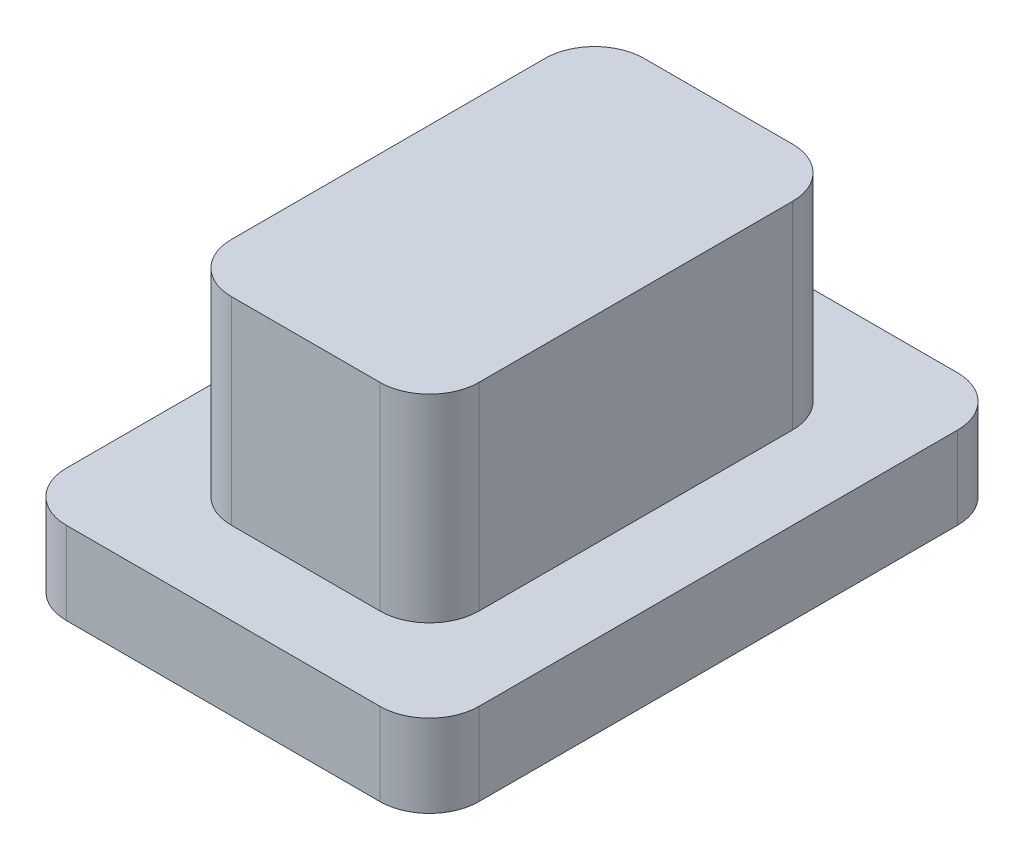
ISO-10303-21;
HEADER;
FILE_DESCRIPTION(('STEP AP214'),'2;1');
FILE_NAME('part.step','',(''),(''),'','','');
FILE_SCHEMA(('AUTOMOTIVE_DESIGN { 1 0 10303 214 1 1 1 1 }'));
ENDSEC;
DATA;
#1=APPLICATION_CONTEXT('core data for automotive mechanical design processes');
#2=APPLICATION_PROTOCOL_DEFINITION('international standard','automotive_design',2000,#1);
#3=PRODUCT_CONTEXT('',#1,'mechanical');
#4=PRODUCT('Part','Part','',(#3));
#5=PRODUCT_RELATED_PRODUCT_CATEGORY('part','',(#4));
#6=PRODUCT_DEFINITION_FORMATION('','',#4);
#7=PRODUCT_DEFINITION_CONTEXT('part definition',#1,'design');
#8=PRODUCT_DEFINITION('design','',#6,#7);
#9=PRODUCT_DEFINITION_SHAPE('','',#8);
#10=(LENGTH_UNIT() NAMED_UNIT(*) SI_UNIT(.MILLI.,.METRE.));
#11=(NAMED_UNIT(*) PLANE_ANGLE_UNIT() SI_UNIT($,.RADIAN.));
#12=(NAMED_UNIT(*) SI_UNIT($,.STERADIAN.) SOLID_ANGLE_UNIT());
#13=UNCERTAINTY_MEASURE_WITH_UNIT(LENGTH_MEASURE(1.E-05),#10,'distance_accuracy_value','');
#14=(GEOMETRIC_REPRESENTATION_CONTEXT(3) GLOBAL_UNCERTAINTY_ASSIGNED_CONTEXT((#13)) GLOBAL_UNIT_ASSIGNED_CONTEXT((#10,
#11,#12)) REPRESENTATION_CONTEXT('',''));
#15=CARTESIAN_POINT('',(0.,0.,0.));
#16=DIRECTION('',(0.,0.,1.));
#17=DIRECTION('',(1.,0.,0.));
#18=AXIS2_PLACEMENT_3D('',#15,#16,#17);
#19=CARTESIAN_POINT('',(2.5,1.,-3.5));
#20=DIRECTION('',(-1.,0.,0.));
#21=DIRECTION('',(0.,0.,1.));
#22=AXIS2_PLACEMENT_3D('',#19,#20,#21);
#23=PLANE('',#22);
#24=DIRECTION('',(0.,0.,-1.));
#25=VECTOR('',#24,1.);
#26=CARTESIAN_POINT('',(2.5,0.,-3.5));
#27=LINE('',#26,#25);
#28=CARTESIAN_POINT('',(2.5,0.,2.9));
#29=VERTEX_POINT('',#28);
#30=CARTESIAN_POINT('',(2.5,0.,-2.9));
#31=VERTEX_POINT('',#30);
#32=EDGE_CURVE('E176',#29,#31,#27,.T.);
#33=ORIENTED_EDGE('',*,*,#32,.T.);
#34=DIRECTION('',(0.,-1.,0.));
#35=VECTOR('',#34,1.);
#36=CARTESIAN_POINT('',(2.5,1.,-2.9));
#37=LINE('',#36,#35);
#38=CARTESIAN_POINT('',(2.5,1.,-2.9));
#39=VERTEX_POINT('',#38);
#40=EDGE_CURVE('E154',#31,#39,#37,.F.);
#41=ORIENTED_EDGE('',*,*,#40,.T.);
#42=DIRECTION('',(0.,0.,-1.));
#43=VECTOR('',#42,1.);
#44=CARTESIAN_POINT('',(2.5,1.,-3.5));
#45=LINE('',#44,#43);
#46=CARTESIAN_POINT('',(2.5,1.,2.9));
#47=VERTEX_POINT('',#46);
#48=EDGE_CURVE('E187',#47,#39,#45,.T.);
#49=ORIENTED_EDGE('',*,*,#48,.F.);
#50=DIRECTION('',(0.,-1.,0.));
#51=VECTOR('',#50,1.);
#52=CARTESIAN_POINT('',(2.5,1.,2.9));
#53=LINE('',#52,#51);
#54=EDGE_CURVE('E159',#47,#29,#53,.T.);
#55=ORIENTED_EDGE('',*,*,#54,.T.);
#56=EDGE_LOOP('',(#33,#41,#49,#55));
#57=FACE_BOUND('',#56,.T.);
#58=ADVANCED_FACE('F35',(#57),#23,.F.);
#59=CARTESIAN_POINT('',(-2.5,1.,-3.5));
#60=DIRECTION('',(0.,0.,1.));
#61=DIRECTION('',(1.,0.,0.));
#62=AXIS2_PLACEMENT_3D('',#59,#60,#61);
#63=PLANE('',#62);
#64=DIRECTION('',(-1.,0.,0.));
#65=VECTOR('',#64,1.);
#66=CARTESIAN_POINT('',(-2.5,1.,-3.5));
#67=LINE('',#66,#65);
#68=CARTESIAN_POINT('',(1.9,1.,-3.5));
#69=VERTEX_POINT('',#68);
#70=CARTESIAN_POINT('',(-1.9,1.,-3.5));
#71=VERTEX_POINT('',#70);
#72=EDGE_CURVE('E169',#69,#71,#67,.T.);
#73=ORIENTED_EDGE('',*,*,#72,.F.);
#74=DIRECTION('',(0.,-1.,0.));
#75=VECTOR('',#74,1.);
#76=CARTESIAN_POINT('',(1.9,1.,-3.5));
#77=LINE('',#76,#75);
#78=CARTESIAN_POINT('',(1.9,0.,-3.5));
#79=VERTEX_POINT('',#78);
#80=EDGE_CURVE('E153',#69,#79,#77,.T.);
#81=ORIENTED_EDGE('',*,*,#80,.T.);
#82=DIRECTION('',(-1.,0.,0.));
#83=VECTOR('',#82,1.);
#84=CARTESIAN_POINT('',(-2.5,0.,-3.5));
#85=LINE('',#84,#83);
#86=CARTESIAN_POINT('',(-1.9,0.,-3.5));
#87=VERTEX_POINT('',#86);
#88=EDGE_CURVE('E166',#79,#87,#85,.T.);
#89=ORIENTED_EDGE('',*,*,#88,.T.);
#90=DIRECTION('',(0.,-1.,0.));
#91=VECTOR('',#90,1.);
#92=CARTESIAN_POINT('',(-1.9,1.,-3.5));
#93=LINE('',#92,#91);
#94=EDGE_CURVE('E171',#87,#71,#93,.F.);
#95=ORIENTED_EDGE('',*,*,#94,.T.);
#96=EDGE_LOOP('',(#73,#81,#89,#95));
#97=FACE_BOUND('',#96,.T.);
#98=ADVANCED_FACE('F165',(#97),#63,.F.);
#99=CARTESIAN_POINT('',(-2.5,1.,-3.5));
#100=DIRECTION('',(1.,0.,0.));
#101=DIRECTION('',(0.,0.,-1.));
#102=AXIS2_PLACEMENT_3D('',#99,#100,#101);
#103=PLANE('',#102);
#104=DIRECTION('',(0.,0.,1.));
#105=VECTOR('',#104,1.);
#106=CARTESIAN_POINT('',(-2.5,1.,-3.5));
#107=LINE('',#106,#105);
#108=CARTESIAN_POINT('',(-2.5,1.,-2.9));
#109=VERTEX_POINT('',#108);
#110=CARTESIAN_POINT('',(-2.5,1.,2.9));
#111=VERTEX_POINT('',#110);
#112=EDGE_CURVE('E285',#109,#111,#107,.T.);
#113=ORIENTED_EDGE('',*,*,#112,.F.);
#114=DIRECTION('',(0.,-1.,0.));
#115=VECTOR('',#114,1.);
#116=CARTESIAN_POINT('',(-2.5,1.,-2.9));
#117=LINE('',#116,#115);
#118=CARTESIAN_POINT('',(-2.5,0.,-2.9));
#119=VERTEX_POINT('',#118);
#120=EDGE_CURVE('E207',#109,#119,#117,.T.);
#121=ORIENTED_EDGE('',*,*,#120,.T.);
#122=DIRECTION('',(0.,0.,1.));
#123=VECTOR('',#122,1.);
#124=CARTESIAN_POINT('',(-2.5,0.,-3.5));
#125=LINE('',#124,#123);
#126=CARTESIAN_POINT('',(-2.5,0.,2.9));
#127=VERTEX_POINT('',#126);
#128=EDGE_CURVE('E175',#119,#127,#125,.T.);
#129=ORIENTED_EDGE('',*,*,#128,.T.);
#130=DIRECTION('',(0.,-1.,0.));
#131=VECTOR('',#130,1.);
#132=CARTESIAN_POINT('',(-2.5,1.,2.9));
#133=LINE('',#132,#131);
#134=EDGE_CURVE('E205',#127,#111,#133,.F.);
#135=ORIENTED_EDGE('',*,*,#134,.T.);
#136=EDGE_LOOP('',(#113,#121,#129,#135));
#137=FACE_BOUND('',#136,.T.);
#138=ADVANCED_FACE('F306',(#137),#103,.F.);
#139=CARTESIAN_POINT('',(-2.5,1.,3.5));
#140=DIRECTION('',(0.,0.,-1.));
#141=DIRECTION('',(-1.,0.,0.));
#142=AXIS2_PLACEMENT_3D('',#139,#140,#141);
#143=PLANE('',#142);
#144=DIRECTION('',(1.,0.,0.));
#145=VECTOR('',#144,1.);
#146=CARTESIAN_POINT('',(-2.5,0.,3.5));
#147=LINE('',#146,#145);
#148=CARTESIAN_POINT('',(-1.9,0.,3.5));
#149=VERTEX_POINT('',#148);
#150=CARTESIAN_POINT('',(1.9,0.,3.5));
#151=VERTEX_POINT('',#150);
#152=EDGE_CURVE('E179',#149,#151,#147,.T.);
#153=ORIENTED_EDGE('',*,*,#152,.T.);
#154=DIRECTION('',(0.,-1.,0.));
#155=VECTOR('',#154,1.);
#156=CARTESIAN_POINT('',(1.9,1.,3.5));
#157=LINE('',#156,#155);
#158=CARTESIAN_POINT('',(1.9,1.,3.5));
#159=VERTEX_POINT('',#158);
#160=EDGE_CURVE('E213',#151,#159,#157,.F.);
#161=ORIENTED_EDGE('',*,*,#160,.T.);
#162=DIRECTION('',(1.,0.,0.));
#163=VECTOR('',#162,1.);
#164=CARTESIAN_POINT('',(-2.5,1.,3.5));
#165=LINE('',#164,#163);
#166=CARTESIAN_POINT('',(-1.9,1.,3.5));
#167=VERTEX_POINT('',#166);
#168=EDGE_CURVE('E188',#167,#159,#165,.T.);
#169=ORIENTED_EDGE('',*,*,#168,.F.);
#170=DIRECTION('',(0.,-1.,0.));
#171=VECTOR('',#170,1.);
#172=CARTESIAN_POINT('',(-1.9,1.,3.5));
#173=LINE('',#172,#171);
#174=EDGE_CURVE('E210',#167,#149,#173,.T.);
#175=ORIENTED_EDGE('',*,*,#174,.T.);
#176=EDGE_LOOP('',(#153,#161,#169,#175));
#177=FACE_BOUND('',#176,.T.);
#178=ADVANCED_FACE('F300',(#177),#143,.F.);
#179=CARTESIAN_POINT('',(0.,1.,0.));
#180=DIRECTION('',(0.,1.,0.));
#181=DIRECTION('',(0.,0.,1.));
#182=AXIS2_PLACEMENT_3D('',#179,#180,#181);
#183=PLANE('',#182);
#184=DIRECTION('',(0.,0.,-1.));
#185=VECTOR('',#184,1.);
#186=CARTESIAN_POINT('',(1.5,1.,-2.5));
#187=LINE('',#186,#185);
#188=CARTESIAN_POINT('',(1.5,1.,1.9));
#189=VERTEX_POINT('',#188);
#190=CARTESIAN_POINT('',(1.5,1.,-1.9));
#191=VERTEX_POINT('',#190);
#192=EDGE_CURVE('E251',#189,#191,#187,.T.);
#193=ORIENTED_EDGE('',*,*,#192,.F.);
#194=CARTESIAN_POINT('',(0.9,1.,1.9));
#195=DIRECTION('',(0.,1.,0.));
#196=DIRECTION('',(0.,0.,1.));
#197=AXIS2_PLACEMENT_3D('',#194,#195,#196);
#198=CIRCLE('',#197,0.6);
#199=CARTESIAN_POINT('',(0.9,1.,2.5));
#200=VERTEX_POINT('',#199);
#201=EDGE_CURVE('E43',#189,#200,#198,.F.);
#202=ORIENTED_EDGE('',*,*,#201,.T.);
#203=DIRECTION('',(1.,0.,0.));
#204=VECTOR('',#203,1.);
#205=CARTESIAN_POINT('',(-1.5,1.,2.5));
#206=LINE('',#205,#204);
#207=CARTESIAN_POINT('',(-0.9,1.,2.5));
#208=VERTEX_POINT('',#207);
#209=EDGE_CURVE('E249',#208,#200,#206,.T.);
#210=ORIENTED_EDGE('',*,*,#209,.F.);
#211=CARTESIAN_POINT('',(-0.9,1.,1.9));
#212=DIRECTION('',(0.,1.,0.));
#213=DIRECTION('',(0.,0.,1.));
#214=AXIS2_PLACEMENT_3D('',#211,#212,#213);
#215=CIRCLE('',#214,0.6);
#216=CARTESIAN_POINT('',(-1.5,1.,1.9));
#217=VERTEX_POINT('',#216);
#218=EDGE_CURVE('E11',#208,#217,#215,.F.);
#219=ORIENTED_EDGE('',*,*,#218,.T.);
#220=DIRECTION('',(0.,0.,1.));
#221=VECTOR('',#220,1.);
#222=CARTESIAN_POINT('',(-1.5,1.,-2.5));
#223=LINE('',#222,#221);
#224=CARTESIAN_POINT('',(-1.5,1.,-1.9));
#225=VERTEX_POINT('',#224);
#226=EDGE_CURVE('E257',#225,#217,#223,.T.);
#227=ORIENTED_EDGE('',*,*,#226,.F.);
#228=CARTESIAN_POINT('',(-0.9,1.,-1.9));
#229=DIRECTION('',(0.,1.,0.));
#230=DIRECTION('',(0.,0.,1.));
#231=AXIS2_PLACEMENT_3D('',#228,#229,#230);
#232=CIRCLE('',#231,0.6);
#233=CARTESIAN_POINT('',(-0.9,1.,-2.5));
#234=VERTEX_POINT('',#233);
#235=EDGE_CURVE('E241',#225,#234,#232,.F.);
#236=ORIENTED_EDGE('',*,*,#235,.T.);
#237=DIRECTION('',(-1.,0.,0.));
#238=VECTOR('',#237,1.);
#239=CARTESIAN_POINT('',(-1.5,1.,-2.5));
#240=LINE('',#239,#238);
#241=CARTESIAN_POINT('',(0.9,1.,-2.5));
#242=VERTEX_POINT('',#241);
#243=EDGE_CURVE('E277',#242,#234,#240,.T.);
#244=ORIENTED_EDGE('',*,*,#243,.F.);
#245=CARTESIAN_POINT('',(0.9,1.,-1.9));
#246=DIRECTION('',(0.,1.,0.));
#247=DIRECTION('',(0.,0.,1.));
#248=AXIS2_PLACEMENT_3D('',#245,#246,#247);
#249=CIRCLE('',#248,0.6);
#250=EDGE_CURVE('E243',#242,#191,#249,.F.);
#251=ORIENTED_EDGE('',*,*,#250,.T.);
#252=EDGE_LOOP('',(#193,#202,#210,#219,#227,#236,#244,#251));
#253=FACE_BOUND('',#252,.T.);
#254=ORIENTED_EDGE('',*,*,#48,.T.);
#255=CARTESIAN_POINT('',(1.9,1.,-2.9));
#256=DIRECTION('',(0.,1.,0.));
#257=DIRECTION('',(0.,0.,1.));
#258=AXIS2_PLACEMENT_3D('',#255,#256,#257);
#259=CIRCLE('',#258,0.6);
#260=EDGE_CURVE('E203',#39,#69,#259,.T.);
#261=ORIENTED_EDGE('',*,*,#260,.T.);
#262=ORIENTED_EDGE('',*,*,#72,.T.);
#263=CARTESIAN_POINT('',(-1.9,1.,-2.9));
#264=DIRECTION('',(0.,1.,0.));
#265=DIRECTION('',(0.,0.,1.));
#266=AXIS2_PLACEMENT_3D('',#263,#264,#265);
#267=CIRCLE('',#266,0.6);
#268=EDGE_CURVE('E201',#71,#109,#267,.T.);
#269=ORIENTED_EDGE('',*,*,#268,.T.);
#270=ORIENTED_EDGE('',*,*,#112,.T.);
#271=CARTESIAN_POINT('',(-1.9,1.,2.9));
#272=DIRECTION('',(0.,1.,0.));
#273=DIRECTION('',(0.,0.,1.));
#274=AXIS2_PLACEMENT_3D('',#271,#272,#273);
#275=CIRCLE('',#274,0.6);
#276=EDGE_CURVE('E197',#111,#167,#275,.T.);
#277=ORIENTED_EDGE('',*,*,#276,.T.);
#278=ORIENTED_EDGE('',*,*,#168,.T.);
#279=CARTESIAN_POINT('',(1.9,1.,2.9));
#280=DIRECTION('',(0.,1.,0.));
#281=DIRECTION('',(0.,0.,1.));
#282=AXIS2_PLACEMENT_3D('',#279,#280,#281);
#283=CIRCLE('',#282,0.6);
#284=EDGE_CURVE('E199',#159,#47,#283,.T.);
#285=ORIENTED_EDGE('',*,*,#284,.T.);
#286=EDGE_LOOP('',(#254,#261,#262,#269,#270,#277,#278,#285));
#287=FACE_BOUND('',#286,.T.);
#288=ADVANCED_FACE('F247',(#253,#287),#183,.T.);
#289=CARTESIAN_POINT('',(0.,0.,0.));
#290=DIRECTION('',(0.,1.,0.));
#291=DIRECTION('',(0.,0.,1.));
#292=AXIS2_PLACEMENT_3D('',#289,#290,#291);
#293=PLANE('',#292);
#294=ORIENTED_EDGE('',*,*,#88,.F.);
#295=CARTESIAN_POINT('',(1.9,0.,-2.9));
#296=DIRECTION('',(0.,1.,0.));
#297=DIRECTION('',(0.,0.,1.));
#298=AXIS2_PLACEMENT_3D('',#295,#296,#297);
#299=CIRCLE('',#298,0.6);
#300=EDGE_CURVE('E149',#79,#31,#299,.F.);
#301=ORIENTED_EDGE('',*,*,#300,.T.);
#302=ORIENTED_EDGE('',*,*,#32,.F.);
#303=CARTESIAN_POINT('',(1.9,0.,2.9));
#304=DIRECTION('',(0.,1.,0.));
#305=DIRECTION('',(0.,0.,1.));
#306=AXIS2_PLACEMENT_3D('',#303,#304,#305);
#307=CIRCLE('',#306,0.6);
#308=EDGE_CURVE('E191',#29,#151,#307,.F.);
#309=ORIENTED_EDGE('',*,*,#308,.T.);
#310=ORIENTED_EDGE('',*,*,#152,.F.);
#311=CARTESIAN_POINT('',(-1.9,0.,2.9));
#312=DIRECTION('',(0.,1.,0.));
#313=DIRECTION('',(0.,0.,1.));
#314=AXIS2_PLACEMENT_3D('',#311,#312,#313);
#315=CIRCLE('',#314,0.6);
#316=EDGE_CURVE('E170',#149,#127,#315,.F.);
#317=ORIENTED_EDGE('',*,*,#316,.T.);
#318=ORIENTED_EDGE('',*,*,#128,.F.);
#319=CARTESIAN_POINT('',(-1.9,0.,-2.9));
#320=DIRECTION('',(0.,1.,0.));
#321=DIRECTION('',(0.,0.,1.));
#322=AXIS2_PLACEMENT_3D('',#319,#320,#321);
#323=CIRCLE('',#322,0.6);
#324=EDGE_CURVE('E160',#119,#87,#323,.F.);
#325=ORIENTED_EDGE('',*,*,#324,.T.);
#326=EDGE_LOOP('',(#294,#301,#302,#309,#310,#317,#318,#325));
#327=FACE_BOUND('',#326,.T.);
#328=ADVANCED_FACE('F173',(#327),#293,.F.);
#329=CARTESIAN_POINT('',(1.5,3.4,-2.5));
#330=DIRECTION('',(-1.,0.,0.));
#331=DIRECTION('',(0.,0.,1.));
#332=AXIS2_PLACEMENT_3D('',#329,#330,#331);
#333=PLANE('',#332);
#334=ORIENTED_EDGE('',*,*,#192,.T.);
#335=DIRECTION('',(0.,-1.,0.));
#336=VECTOR('',#335,1.);
#337=CARTESIAN_POINT('',(1.5,3.4,-1.9));
#338=LINE('',#337,#336);
#339=CARTESIAN_POINT('',(1.5,3.4,-1.9));
#340=VERTEX_POINT('',#339);
#341=EDGE_CURVE('E235',#191,#340,#338,.F.);
#342=ORIENTED_EDGE('',*,*,#341,.T.);
#343=DIRECTION('',(0.,0.,-1.));
#344=VECTOR('',#343,1.);
#345=CARTESIAN_POINT('',(1.5,3.4,-2.5));
#346=LINE('',#345,#344);
#347=CARTESIAN_POINT('',(1.5,3.4,1.9));
#348=VERTEX_POINT('',#347);
#349=EDGE_CURVE('E256',#348,#340,#346,.T.);
#350=ORIENTED_EDGE('',*,*,#349,.F.);
#351=DIRECTION('',(0.,-1.,0.));
#352=VECTOR('',#351,1.);
#353=CARTESIAN_POINT('',(1.5,3.4,1.9));
#354=LINE('',#353,#352);
#355=EDGE_CURVE('E232',#348,#189,#354,.T.);
#356=ORIENTED_EDGE('',*,*,#355,.T.);
#357=EDGE_LOOP('',(#334,#342,#350,#356));
#358=FACE_BOUND('',#357,.T.);
#359=ADVANCED_FACE('F267',(#358),#333,.F.);
#360=CARTESIAN_POINT('',(-1.5,3.4,-2.5));
#361=DIRECTION('',(0.,0.,1.));
#362=DIRECTION('',(1.,0.,0.));
#363=AXIS2_PLACEMENT_3D('',#360,#361,#362);
#364=PLANE('',#363);
#365=ORIENTED_EDGE('',*,*,#243,.T.);
#366=DIRECTION('',(0.,-1.,0.));
#367=VECTOR('',#366,1.);
#368=CARTESIAN_POINT('',(-0.9,3.4,-2.5));
#369=LINE('',#368,#367);
#370=CARTESIAN_POINT('',(-0.9,3.4,-2.5));
#371=VERTEX_POINT('',#370);
#372=EDGE_CURVE('E223',#234,#371,#369,.F.);
#373=ORIENTED_EDGE('',*,*,#372,.T.);
#374=DIRECTION('',(-1.,0.,0.));
#375=VECTOR('',#374,1.);
#376=CARTESIAN_POINT('',(-1.5,3.4,-2.5));
#377=LINE('',#376,#375);
#378=CARTESIAN_POINT('',(0.9,3.4,-2.5));
#379=VERTEX_POINT('',#378);
#380=EDGE_CURVE('E269',#379,#371,#377,.T.);
#381=ORIENTED_EDGE('',*,*,#380,.F.);
#382=DIRECTION('',(0.,-1.,0.));
#383=VECTOR('',#382,1.);
#384=CARTESIAN_POINT('',(0.9,3.4,-2.5));
#385=LINE('',#384,#383);
#386=EDGE_CURVE('E220',#379,#242,#385,.T.);
#387=ORIENTED_EDGE('',*,*,#386,.T.);
#388=EDGE_LOOP('',(#365,#373,#381,#387));
#389=FACE_BOUND('',#388,.T.);
#390=ADVANCED_FACE('F336',(#389),#364,.F.);
#391=CARTESIAN_POINT('',(-1.5,3.4,-2.5));
#392=DIRECTION('',(1.,0.,0.));
#393=DIRECTION('',(0.,0.,-1.));
#394=AXIS2_PLACEMENT_3D('',#391,#392,#393);
#395=PLANE('',#394);
#396=DIRECTION('',(0.,0.,1.));
#397=VECTOR('',#396,1.);
#398=CARTESIAN_POINT('',(-1.5,3.4,-2.5));
#399=LINE('',#398,#397);
#400=CARTESIAN_POINT('',(-1.5,3.4,-1.9));
#401=VERTEX_POINT('',#400);
#402=CARTESIAN_POINT('',(-1.5,3.4,1.9));
#403=VERTEX_POINT('',#402);
#404=EDGE_CURVE('E271',#401,#403,#399,.T.);
#405=ORIENTED_EDGE('',*,*,#404,.F.);
#406=DIRECTION('',(0.,-1.,0.));
#407=VECTOR('',#406,1.);
#408=CARTESIAN_POINT('',(-1.5,3.4,-1.9));
#409=LINE('',#408,#407);
#410=EDGE_CURVE('E217',#401,#225,#409,.T.);
#411=ORIENTED_EDGE('',*,*,#410,.T.);
#412=ORIENTED_EDGE('',*,*,#226,.T.);
#413=DIRECTION('',(0.,-1.,0.));
#414=VECTOR('',#413,1.);
#415=CARTESIAN_POINT('',(-1.5,3.4,1.9));
#416=LINE('',#415,#414);
#417=EDGE_CURVE('E215',#217,#403,#416,.F.);
#418=ORIENTED_EDGE('',*,*,#417,.T.);
#419=EDGE_LOOP('',(#405,#411,#412,#418));
#420=FACE_BOUND('',#419,.T.);
#421=ADVANCED_FACE('F339',(#420),#395,.F.);
#422=CARTESIAN_POINT('',(-1.5,3.4,2.5));
#423=DIRECTION('',(0.,0.,-1.));
#424=DIRECTION('',(-1.,0.,0.));
#425=AXIS2_PLACEMENT_3D('',#422,#423,#424);
#426=PLANE('',#425);
#427=ORIENTED_EDGE('',*,*,#209,.T.);
#428=DIRECTION('',(0.,-1.,0.));
#429=VECTOR('',#428,1.);
#430=CARTESIAN_POINT('',(0.9,3.4,2.5));
#431=LINE('',#430,#429);
#432=CARTESIAN_POINT('',(0.9,3.4,2.5));
#433=VERTEX_POINT('',#432);
#434=EDGE_CURVE('E50',#200,#433,#431,.F.);
#435=ORIENTED_EDGE('',*,*,#434,.T.);
#436=DIRECTION('',(1.,0.,0.));
#437=VECTOR('',#436,1.);
#438=CARTESIAN_POINT('',(-1.5,3.4,2.5));
#439=LINE('',#438,#437);
#440=CARTESIAN_POINT('',(-0.9,3.4,2.5));
#441=VERTEX_POINT('',#440);
#442=EDGE_CURVE('E181',#441,#433,#439,.T.);
#443=ORIENTED_EDGE('',*,*,#442,.F.);
#444=DIRECTION('',(0.,-1.,0.));
#445=VECTOR('',#444,1.);
#446=CARTESIAN_POINT('',(-0.9,3.4,2.5));
#447=LINE('',#446,#445);
#448=EDGE_CURVE('E237',#441,#208,#447,.T.);
#449=ORIENTED_EDGE('',*,*,#448,.T.);
#450=EDGE_LOOP('',(#427,#435,#443,#449));
#451=FACE_BOUND('',#450,.T.);
#452=ADVANCED_FACE('F254',(#451),#426,.F.);
#453=CARTESIAN_POINT('',(0.,3.4,0.));
#454=DIRECTION('',(0.,1.,0.));
#455=DIRECTION('',(0.,0.,1.));
#456=AXIS2_PLACEMENT_3D('',#453,#454,#455);
#457=PLANE('',#456);
#458=ORIENTED_EDGE('',*,*,#380,.T.);
#459=CARTESIAN_POINT('',(-0.9,3.4,-1.9));
#460=DIRECTION('',(0.,1.,0.));
#461=DIRECTION('',(0.,0.,1.));
#462=AXIS2_PLACEMENT_3D('',#459,#460,#461);
#463=CIRCLE('',#462,0.6);
#464=EDGE_CURVE('E230',#371,#401,#463,.T.);
#465=ORIENTED_EDGE('',*,*,#464,.T.);
#466=ORIENTED_EDGE('',*,*,#404,.T.);
#467=CARTESIAN_POINT('',(-0.9,3.4,1.9));
#468=DIRECTION('',(0.,1.,0.));
#469=DIRECTION('',(0.,0.,1.));
#470=AXIS2_PLACEMENT_3D('',#467,#468,#469);
#471=CIRCLE('',#470,0.6);
#472=EDGE_CURVE('E57',#403,#441,#471,.T.);
#473=ORIENTED_EDGE('',*,*,#472,.T.);
#474=ORIENTED_EDGE('',*,*,#442,.T.);
#475=CARTESIAN_POINT('',(0.9,3.4,1.9));
#476=DIRECTION('',(0.,1.,0.));
#477=DIRECTION('',(0.,0.,1.));
#478=AXIS2_PLACEMENT_3D('',#475,#476,#477);
#479=CIRCLE('',#478,0.6);
#480=EDGE_CURVE('E226',#433,#348,#479,.T.);
#481=ORIENTED_EDGE('',*,*,#480,.T.);
#482=ORIENTED_EDGE('',*,*,#349,.T.);
#483=CARTESIAN_POINT('',(0.9,3.4,-1.9));
#484=DIRECTION('',(0.,1.,0.));
#485=DIRECTION('',(0.,0.,1.));
#486=AXIS2_PLACEMENT_3D('',#483,#484,#485);
#487=CIRCLE('',#486,0.6);
#488=EDGE_CURVE('E228',#340,#379,#487,.T.);
#489=ORIENTED_EDGE('',*,*,#488,.T.);
#490=EDGE_LOOP('',(#458,#465,#466,#473,#474,#481,#482,#489));
#491=FACE_BOUND('',#490,.T.);
#492=ADVANCED_FACE('F264',(#491),#457,.T.);
#493=CARTESIAN_POINT('',(1.9,1.,-2.9));
#494=DIRECTION('',(0.,-1.,0.));
#495=DIRECTION('',(0.,0.,-1.));
#496=AXIS2_PLACEMENT_3D('',#493,#494,#495);
#497=CYLINDRICAL_SURFACE('',#496,0.6);
#498=ORIENTED_EDGE('',*,*,#260,.F.);
#499=ORIENTED_EDGE('',*,*,#40,.F.);
#500=ORIENTED_EDGE('',*,*,#300,.F.);
#501=ORIENTED_EDGE('',*,*,#80,.F.);
#502=EDGE_LOOP('',(#498,#499,#500,#501));
#503=FACE_BOUND('',#502,.T.);
#504=ADVANCED_FACE('F152',(#503),#497,.T.);
#505=CARTESIAN_POINT('',(-1.9,1.,-2.9));
#506=DIRECTION('',(0.,-1.,0.));
#507=DIRECTION('',(0.,0.,-1.));
#508=AXIS2_PLACEMENT_3D('',#505,#506,#507);
#509=CYLINDRICAL_SURFACE('',#508,0.6);
#510=ORIENTED_EDGE('',*,*,#268,.F.);
#511=ORIENTED_EDGE('',*,*,#94,.F.);
#512=ORIENTED_EDGE('',*,*,#324,.F.);
#513=ORIENTED_EDGE('',*,*,#120,.F.);
#514=EDGE_LOOP('',(#510,#511,#512,#513));
#515=FACE_BOUND('',#514,.T.);
#516=ADVANCED_FACE('F310',(#515),#509,.T.);
#517=CARTESIAN_POINT('',(1.9,1.,2.9));
#518=DIRECTION('',(0.,-1.,0.));
#519=DIRECTION('',(0.,0.,-1.));
#520=AXIS2_PLACEMENT_3D('',#517,#518,#519);
#521=CYLINDRICAL_SURFACE('',#520,0.6);
#522=ORIENTED_EDGE('',*,*,#284,.F.);
#523=ORIENTED_EDGE('',*,*,#160,.F.);
#524=ORIENTED_EDGE('',*,*,#308,.F.);
#525=ORIENTED_EDGE('',*,*,#54,.F.);
#526=EDGE_LOOP('',(#522,#523,#524,#525));
#527=FACE_BOUND('',#526,.T.);
#528=ADVANCED_FACE('F297',(#527),#521,.T.);
#529=CARTESIAN_POINT('',(-1.9,1.,2.9));
#530=DIRECTION('',(0.,-1.,0.));
#531=DIRECTION('',(0.,0.,-1.));
#532=AXIS2_PLACEMENT_3D('',#529,#530,#531);
#533=CYLINDRICAL_SURFACE('',#532,0.6);
#534=ORIENTED_EDGE('',*,*,#276,.F.);
#535=ORIENTED_EDGE('',*,*,#134,.F.);
#536=ORIENTED_EDGE('',*,*,#316,.F.);
#537=ORIENTED_EDGE('',*,*,#174,.F.);
#538=EDGE_LOOP('',(#534,#535,#536,#537));
#539=FACE_BOUND('',#538,.T.);
#540=ADVANCED_FACE('F302',(#539),#533,.T.);
#541=CARTESIAN_POINT('',(-0.9,3.4,-1.9));
#542=DIRECTION('',(0.,-1.,0.));
#543=DIRECTION('',(0.,0.,-1.));
#544=AXIS2_PLACEMENT_3D('',#541,#542,#543);
#545=CYLINDRICAL_SURFACE('',#544,0.6);
#546=ORIENTED_EDGE('',*,*,#464,.F.);
#547=ORIENTED_EDGE('',*,*,#372,.F.);
#548=ORIENTED_EDGE('',*,*,#235,.F.);
#549=ORIENTED_EDGE('',*,*,#410,.F.);
#550=EDGE_LOOP('',(#546,#547,#548,#549));
#551=FACE_BOUND('',#550,.T.);
#552=ADVANCED_FACE('F374',(#551),#545,.T.);
#553=CARTESIAN_POINT('',(0.9,3.4,-1.9));
#554=DIRECTION('',(0.,-1.,0.));
#555=DIRECTION('',(0.,0.,-1.));
#556=AXIS2_PLACEMENT_3D('',#553,#554,#555);
#557=CYLINDRICAL_SURFACE('',#556,0.6);
#558=ORIENTED_EDGE('',*,*,#488,.F.);
#559=ORIENTED_EDGE('',*,*,#341,.F.);
#560=ORIENTED_EDGE('',*,*,#250,.F.);
#561=ORIENTED_EDGE('',*,*,#386,.F.);
#562=EDGE_LOOP('',(#558,#559,#560,#561));
#563=FACE_BOUND('',#562,.T.);
#564=ADVANCED_FACE('F383',(#563),#557,.T.);
#565=CARTESIAN_POINT('',(0.9,3.4,1.9));
#566=DIRECTION('',(0.,-1.,0.));
#567=DIRECTION('',(0.,0.,-1.));
#568=AXIS2_PLACEMENT_3D('',#565,#566,#567);
#569=CYLINDRICAL_SURFACE('',#568,0.6);
#570=ORIENTED_EDGE('',*,*,#480,.F.);
#571=ORIENTED_EDGE('',*,*,#434,.F.);
#572=ORIENTED_EDGE('',*,*,#201,.F.);
#573=ORIENTED_EDGE('',*,*,#355,.F.);
#574=EDGE_LOOP('',(#570,#571,#572,#573));
#575=FACE_BOUND('',#574,.T.);
#576=ADVANCED_FACE('F260',(#575),#569,.T.);
#577=CARTESIAN_POINT('',(-0.9,3.4,1.9));
#578=DIRECTION('',(0.,-1.,0.));
#579=DIRECTION('',(0.,0.,-1.));
#580=AXIS2_PLACEMENT_3D('',#577,#578,#579);
#581=CYLINDRICAL_SURFACE('',#580,0.6);
#582=ORIENTED_EDGE('',*,*,#472,.F.);
#583=ORIENTED_EDGE('',*,*,#417,.F.);
#584=ORIENTED_EDGE('',*,*,#218,.F.);
#585=ORIENTED_EDGE('',*,*,#448,.F.);
#586=EDGE_LOOP('',(#582,#583,#584,#585));
#587=FACE_BOUND('',#586,.T.);
#588=ADVANCED_FACE('F37',(#587),#581,.T.);
#589=CLOSED_SHELL('',(#58,#98,#138,#178,#288,#328,#359,#390,#421,#452,#492,#504,#516,#528,#540,
#552,#564,#576,#588));
#590=MANIFOLD_SOLID_BREP('B2',#589);
#591=ADVANCED_BREP_SHAPE_REPRESENTATION('',(#18,#590),#14);
#592=SHAPE_DEFINITION_REPRESENTATION(#9,#591);
ENDSEC;
END-ISO-10303-21;
